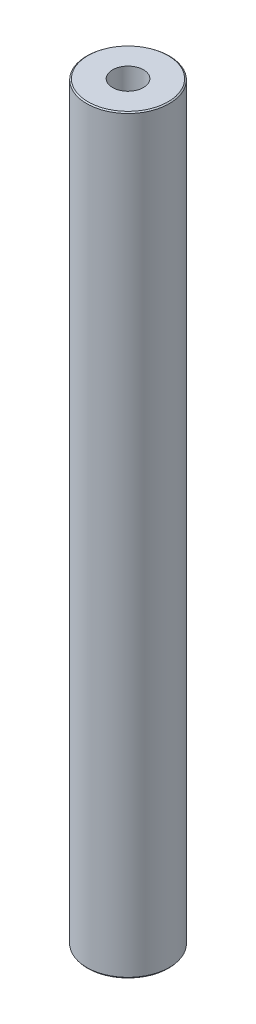
ISO-10303-21;
HEADER;
FILE_DESCRIPTION(('STEP AP214'),'2;1');
FILE_NAME('part.step','',(''),(''),'','','');
FILE_SCHEMA(('AUTOMOTIVE_DESIGN { 1 0 10303 214 1 1 1 1 }'));
ENDSEC;
DATA;
#1=APPLICATION_CONTEXT('core data for automotive mechanical design processes');
#2=APPLICATION_PROTOCOL_DEFINITION('international standard','automotive_design',2000,#1);
#3=PRODUCT_CONTEXT('',#1,'mechanical');
#4=PRODUCT('Part','Part','',(#3));
#5=PRODUCT_RELATED_PRODUCT_CATEGORY('part','',(#4));
#6=PRODUCT_DEFINITION_FORMATION('','',#4);
#7=PRODUCT_DEFINITION_CONTEXT('part definition',#1,'design');
#8=PRODUCT_DEFINITION('design','',#6,#7);
#9=PRODUCT_DEFINITION_SHAPE('','',#8);
#10=(LENGTH_UNIT() NAMED_UNIT(*) SI_UNIT(.MILLI.,.METRE.));
#11=(NAMED_UNIT(*) PLANE_ANGLE_UNIT() SI_UNIT($,.RADIAN.));
#12=(NAMED_UNIT(*) SI_UNIT($,.STERADIAN.) SOLID_ANGLE_UNIT());
#13=UNCERTAINTY_MEASURE_WITH_UNIT(LENGTH_MEASURE(1.E-05),#10,'distance_accuracy_value','');
#14=(GEOMETRIC_REPRESENTATION_CONTEXT(3) GLOBAL_UNCERTAINTY_ASSIGNED_CONTEXT((#13)) GLOBAL_UNIT_ASSIGNED_CONTEXT((#10,
#11,#12)) REPRESENTATION_CONTEXT('',''));
#15=CARTESIAN_POINT('',(0.,0.,0.));
#16=DIRECTION('',(0.,0.,1.));
#17=DIRECTION('',(1.,0.,0.));
#18=AXIS2_PLACEMENT_3D('',#15,#16,#17);
#19=CARTESIAN_POINT('',(0.,544.953721629666,0.));
#20=DIRECTION('',(0.,-1.,0.));
#21=DIRECTION('',(0.,0.,-1.));
#22=AXIS2_PLACEMENT_3D('',#19,#20,#21);
#23=CYLINDRICAL_SURFACE('',#22,30.);
#24=CARTESIAN_POINT('',(0.,544.239110756759,0.));
#25=DIRECTION('',(0.,1.,0.));
#26=DIRECTION('',(0.,0.,1.));
#27=AXIS2_PLACEMENT_3D('',#24,#25,#26);
#28=CIRCLE('',#27,30.);
#29=CARTESIAN_POINT('',(0.,544.239110756759,-30.));
#30=VERTEX_POINT('',#29);
#31=EDGE_CURVE('E50',#30,#30,#28,.F.);
#32=CARTESIAN_POINT('',(0.,0.913185378331627,0.));
#33=DIRECTION('',(0.,1.,0.));
#34=DIRECTION('',(0.,0.,1.));
#35=AXIS2_PLACEMENT_3D('',#32,#33,#34);
#36=CIRCLE('',#35,30.);
#37=CARTESIAN_POINT('',(0.,0.913185378331627,-30.));
#38=VERTEX_POINT('',#37);
#39=EDGE_CURVE('E51',#38,#38,#36,.T.);
#40=CARTESIAN_POINT('',(0.,544.239110756759,-30.));
#41=CARTESIAN_POINT('',(0.,538.579465700734,-30.));
#42=CARTESIAN_POINT('',(0.,532.919820644708,-30.));
#43=CARTESIAN_POINT('',(0.,521.600530532658,-30.));
#44=CARTESIAN_POINT('',(0.,515.940885476633,-30.));
#45=CARTESIAN_POINT('',(0.,504.621595364582,-30.));
#46=CARTESIAN_POINT('',(0.,498.961950308557,-30.));
#47=CARTESIAN_POINT('',(0.,487.642660196506,-30.));
#48=CARTESIAN_POINT('',(0.,481.983015140481,-30.));
#49=CARTESIAN_POINT('',(0.,470.66372502843,-30.));
#50=CARTESIAN_POINT('',(0.,465.004079972405,-30.));
#51=CARTESIAN_POINT('',(0.,453.684789860354,-30.));
#52=CARTESIAN_POINT('',(0.,448.025144804329,-30.));
#53=CARTESIAN_POINT('',(0.,436.705854692279,-30.));
#54=CARTESIAN_POINT('',(0.,431.046209636253,-30.));
#55=CARTESIAN_POINT('',(0.,419.726919524203,-30.));
#56=CARTESIAN_POINT('',(0.,414.067274468177,-30.));
#57=CARTESIAN_POINT('',(0.,402.747984356127,-30.));
#58=CARTESIAN_POINT('',(0.,397.088339300102,-30.));
#59=CARTESIAN_POINT('',(0.,385.769049188051,-30.));
#60=CARTESIAN_POINT('',(0.,380.109404132026,-30.));
#61=CARTESIAN_POINT('',(0.,368.790114019975,-30.));
#62=CARTESIAN_POINT('',(0.,363.13046896395,-30.));
#63=CARTESIAN_POINT('',(0.,351.811178851899,-30.));
#64=CARTESIAN_POINT('',(0.,346.151533795874,-30.));
#65=CARTESIAN_POINT('',(0.,334.832243683823,-30.));
#66=CARTESIAN_POINT('',(0.,329.172598627798,-30.));
#67=CARTESIAN_POINT('',(0.,317.853308515748,-30.));
#68=CARTESIAN_POINT('',(0.,312.193663459722,-30.));
#69=CARTESIAN_POINT('',(0.,300.874373347672,-30.));
#70=CARTESIAN_POINT('',(0.,295.214728291646,-30.));
#71=CARTESIAN_POINT('',(0.,283.895438179596,-30.));
#72=CARTESIAN_POINT('',(0.,278.235793123571,-30.));
#73=CARTESIAN_POINT('',(0.,266.91650301152,-30.));
#74=CARTESIAN_POINT('',(0.,261.256857955495,-30.));
#75=CARTESIAN_POINT('',(0.,249.937567843444,-30.));
#76=CARTESIAN_POINT('',(0.,244.277922787419,-30.));
#77=CARTESIAN_POINT('',(0.,232.958632675368,-30.));
#78=CARTESIAN_POINT('',(0.,227.298987619343,-30.));
#79=CARTESIAN_POINT('',(0.,215.979697507292,-30.));
#80=CARTESIAN_POINT('',(0.,210.320052451267,-30.));
#81=CARTESIAN_POINT('',(0.,199.000762339217,-30.));
#82=CARTESIAN_POINT('',(0.,193.341117283191,-30.));
#83=CARTESIAN_POINT('',(0.,182.021827171141,-30.));
#84=CARTESIAN_POINT('',(0.,176.362182115115,-30.));
#85=CARTESIAN_POINT('',(0.,165.042892003065,-30.));
#86=CARTESIAN_POINT('',(0.,159.38324694704,-30.));
#87=CARTESIAN_POINT('',(0.,148.063956834989,-30.));
#88=CARTESIAN_POINT('',(0.,142.404311778964,-30.));
#89=CARTESIAN_POINT('',(0.,131.085021666913,-30.));
#90=CARTESIAN_POINT('',(0.,125.425376610888,-30.));
#91=CARTESIAN_POINT('',(0.,114.106086498837,-30.));
#92=CARTESIAN_POINT('',(0.,108.446441442812,-30.));
#93=CARTESIAN_POINT('',(0.,97.1271513307614,-30.));
#94=CARTESIAN_POINT('',(0.,91.4675062747362,-30.));
#95=CARTESIAN_POINT('',(0.,80.1482161626856,-30.));
#96=CARTESIAN_POINT('',(0.,74.4885711066603,-30.));
#97=CARTESIAN_POINT('',(0.,63.1692809946097,-30.));
#98=CARTESIAN_POINT('',(0.,57.5096359385844,-30.));
#99=CARTESIAN_POINT('',(0.,46.1903458265339,-30.));
#100=CARTESIAN_POINT('',(0.,40.5307007705085,-30.));
#101=CARTESIAN_POINT('',(0.,29.211410658458,-30.));
#102=CARTESIAN_POINT('',(0.,23.5517656024327,-30.));
#103=CARTESIAN_POINT('',(0.,12.2324754903822,-30.));
#104=CARTESIAN_POINT('',(0.,6.57283043435689,-30.));
#105=CARTESIAN_POINT('',(0.,0.913185378331627,-30.));
#106=B_SPLINE_CURVE_WITH_KNOTS('',3,(#40,#41,#42,#43,#44,#45,#46,#47,#48,#49,#50,#51,#52,#53,
#54,#55,#56,#57,#58,#59,#60,#61,#62,#63,#64,#65,#66,#67,#68,#69,#70,#71,#72,#73,#74,#75,#76,#77,
#78,#79,#80,#81,#82,#83,#84,#85,#86,#87,#88,#89,#90,#91,#92,#93,#94,#95,#96,#97,#98,#99,#100,
#101,#102,#103,#104,#105),.UNSPECIFIED.,.F.,.F.,(4,2,2,2,2,2,2,2,2,2,2,2,2,2,2,2,2,2,2,2,2,2,2,
2,2,2,2,2,2,2,2,2,4),(0.,16.9789351680758,33.9578703361516,50.9368055042275,67.9157406723034,
84.8946758403792,101.873611008455,118.852546176531,135.831481344607,152.810416512683,
169.789351680759,186.768286848834,203.74722201691,220.726157184986,237.705092353062,
254.684027521138,271.662962689214,288.64189785729,305.620833025365,322.599768193441,
339.578703361517,356.557638529593,373.536573697669,390.515508865745,407.494444033821,
424.473379201896,441.452314369972,458.431249538048,475.410184706124,492.3891198742,
509.368055042276,526.346990210352,543.325925378427),.UNSPECIFIED.);
#107=EDGE_CURVE('BSEAM39',#30,#38,#106,.T.);
#108=ORIENTED_EDGE('',*,*,#31,.T.);
#109=ORIENTED_EDGE('',*,*,#39,.T.);
#110=ORIENTED_EDGE('',*,*,#107,.T.);
#111=ORIENTED_EDGE('',*,*,#107,.F.);
#112=EDGE_LOOP('',(#108,#110,#109,#111));
#113=FACE_BOUND('',#112,.T.);
#114=ADVANCED_FACE('F39',(#113),#23,.T.);
#115=CARTESIAN_POINT('',(0.,544.953721629666,0.));
#116=DIRECTION('',(0.,1.,0.));
#117=DIRECTION('',(0.,0.,1.));
#118=AXIS2_PLACEMENT_3D('',#115,#116,#117);
#119=PLANE('',#118);
#120=CARTESIAN_POINT('',(0.,544.953721629666,0.));
#121=DIRECTION('',(0.,1.,0.));
#122=DIRECTION('',(0.,0.,1.));
#123=AXIS2_PLACEMENT_3D('',#120,#121,#122);
#124=CIRCLE('',#123,29.0868146216682);
#125=CARTESIAN_POINT('',(0.,544.953721629666,-29.0868146216682));
#126=VERTEX_POINT('',#125);
#127=EDGE_CURVE('E54',#126,#126,#124,.T.);
#128=ORIENTED_EDGE('',*,*,#127,.T.);
#129=EDGE_LOOP('',(#128));
#130=FACE_BOUND('',#129,.T.);
#131=CARTESIAN_POINT('',(0.,544.953721629666,0.));
#132=DIRECTION('',(0.,1.,0.));
#133=DIRECTION('',(0.,0.,1.));
#134=AXIS2_PLACEMENT_3D('',#131,#132,#133);
#135=CIRCLE('',#134,11.2205086014266);
#136=CARTESIAN_POINT('',(0.,544.953721629666,11.2205086014266));
#137=VERTEX_POINT('',#136);
#138=EDGE_CURVE('E58',#137,#137,#135,.T.);
#139=ORIENTED_EDGE('',*,*,#138,.F.);
#140=EDGE_LOOP('',(#139));
#141=FACE_BOUND('',#140,.T.);
#142=ADVANCED_FACE('F69',(#130,#141),#119,.T.);
#143=CARTESIAN_POINT('',(0.,0.,0.));
#144=DIRECTION('',(0.,1.,0.));
#145=DIRECTION('',(0.,0.,1.));
#146=AXIS2_PLACEMENT_3D('',#143,#144,#145);
#147=PLANE('',#146);
#148=CARTESIAN_POINT('',(0.,0.,0.));
#149=DIRECTION('',(0.,1.,0.));
#150=DIRECTION('',(0.,0.,1.));
#151=AXIS2_PLACEMENT_3D('',#148,#149,#150);
#152=CIRCLE('',#151,29.2853891270933);
#153=CARTESIAN_POINT('',(0.,0.,29.2853891270933));
#154=VERTEX_POINT('',#153);
#155=EDGE_CURVE('E10',#154,#154,#152,.F.);
#156=ORIENTED_EDGE('',*,*,#155,.T.);
#157=EDGE_LOOP('',(#156));
#158=FACE_BOUND('',#157,.T.);
#159=CARTESIAN_POINT('',(0.,0.,0.));
#160=DIRECTION('',(0.,1.,0.));
#161=DIRECTION('',(0.,0.,1.));
#162=AXIS2_PLACEMENT_3D('',#159,#160,#161);
#163=CIRCLE('',#162,11.2205086014266);
#164=CARTESIAN_POINT('',(0.,0.,11.2205086014266));
#165=VERTEX_POINT('',#164);
#166=EDGE_CURVE('E63',#165,#165,#163,.T.);
#167=ORIENTED_EDGE('',*,*,#166,.T.);
#168=EDGE_LOOP('',(#167));
#169=FACE_BOUND('',#168,.T.);
#170=ADVANCED_FACE('F75',(#158,#169),#147,.F.);
#171=CARTESIAN_POINT('',(0.,544.953721629666,0.));
#172=DIRECTION('',(0.,-1.,0.));
#173=DIRECTION('',(0.,0.,-1.));
#174=AXIS2_PLACEMENT_3D('',#171,#172,#173);
#175=CYLINDRICAL_SURFACE('',#174,11.2205086014266);
#176=ORIENTED_EDGE('',*,*,#138,.T.);
#177=EDGE_LOOP('',(#176));
#178=FACE_BOUND('',#177,.T.);
#179=ORIENTED_EDGE('',*,*,#166,.F.);
#180=EDGE_LOOP('',(#179));
#181=FACE_BOUND('',#180,.T.);
#182=ADVANCED_FACE('F70',(#178,#181),#175,.F.);
#183=CARTESIAN_POINT('',(0.,544.953721629666,0.));
#184=DIRECTION('',(0.,-1.,0.));
#185=DIRECTION('',(0.,0.,-1.));
#186=AXIS2_PLACEMENT_3D('',#183,#184,#185);
#187=CONICAL_SURFACE('',#186,29.0868146216682,0.906788158513162);
#188=CARTESIAN_POINT('',(0.,544.239110756759,-30.0000000000001));
#189=CARTESIAN_POINT('',(0.,544.246554620019,-29.9904876523091));
#190=CARTESIAN_POINT('',(0.,544.253998483278,-29.9809753046181));
#191=CARTESIAN_POINT('',(0.,544.268886209797,-29.9619506092362));
#192=CARTESIAN_POINT('',(0.,544.276330073056,-29.9524382615453));
#193=CARTESIAN_POINT('',(0.,544.291217799575,-29.9334135661634));
#194=CARTESIAN_POINT('',(0.,544.298661662835,-29.9239012184724));
#195=CARTESIAN_POINT('',(0.,544.313549389354,-29.9048765230905));
#196=CARTESIAN_POINT('',(0.,544.320993252613,-29.8953641753995));
#197=CARTESIAN_POINT('',(0.,544.335880979132,-29.8763394800176));
#198=CARTESIAN_POINT('',(0.,544.343324842391,-29.8668271323267));
#199=CARTESIAN_POINT('',(0.,544.35821256891,-29.8478024369448));
#200=CARTESIAN_POINT('',(0.,544.36565643217,-29.8382900892538));
#201=CARTESIAN_POINT('',(0.,544.380544158689,-29.8192653938719));
#202=CARTESIAN_POINT('',(0.,544.387988021948,-29.8097530461809));
#203=CARTESIAN_POINT('',(0.,544.402875748467,-29.790728350799));
#204=CARTESIAN_POINT('',(0.,544.410319611726,-29.7812160031081));
#205=CARTESIAN_POINT('',(0.,544.425207338245,-29.7621913077262));
#206=CARTESIAN_POINT('',(0.,544.432651201505,-29.7526789600352));
#207=CARTESIAN_POINT('',(0.,544.447538928024,-29.7336542646533));
#208=CARTESIAN_POINT('',(0.,544.454982791283,-29.7241419169623));
#209=CARTESIAN_POINT('',(0.,544.469870517802,-29.7051172215804));
#210=CARTESIAN_POINT('',(0.,544.477314381061,-29.6956048738895));
#211=CARTESIAN_POINT('',(0.,544.49220210758,-29.6765801785075));
#212=CARTESIAN_POINT('',(0.,544.49964597084,-29.6670678308166));
#213=CARTESIAN_POINT('',(0.,544.514533697359,-29.6480431354347));
#214=CARTESIAN_POINT('',(0.,544.521977560618,-29.6385307877437));
#215=CARTESIAN_POINT('',(0.,544.536865287137,-29.6195060923618));
#216=CARTESIAN_POINT('',(0.,544.544309150396,-29.6099937446708));
#217=CARTESIAN_POINT('',(0.,544.559196876915,-29.5909690492889));
#218=CARTESIAN_POINT('',(0.,544.566640740175,-29.581456701598));
#219=CARTESIAN_POINT('',(0.,544.581528466694,-29.5624320062161));
#220=CARTESIAN_POINT('',(0.,544.588972329953,-29.5529196585251));
#221=CARTESIAN_POINT('',(0.,544.603860056472,-29.5338949631432));
#222=CARTESIAN_POINT('',(0.,544.611303919731,-29.5243826154522));
#223=CARTESIAN_POINT('',(0.,544.62619164625,-29.5053579200703));
#224=CARTESIAN_POINT('',(0.,544.63363550951,-29.4958455723794));
#225=CARTESIAN_POINT('',(0.,544.648523236029,-29.4768208769975));
#226=CARTESIAN_POINT('',(0.,544.655967099288,-29.4673085293065));
#227=CARTESIAN_POINT('',(0.,544.670854825807,-29.4482838339246));
#228=CARTESIAN_POINT('',(0.,544.678298689066,-29.4387714862336));
#229=CARTESIAN_POINT('',(0.,544.693186415585,-29.4197467908517));
#230=CARTESIAN_POINT('',(0.,544.700630278845,-29.4102344431608));
#231=CARTESIAN_POINT('',(0.,544.715518005364,-29.3912097477789));
#232=CARTESIAN_POINT('',(0.,544.722961868623,-29.3816974000879));
#233=CARTESIAN_POINT('',(0.,544.737849595142,-29.362672704706));
#234=CARTESIAN_POINT('',(0.,544.745293458401,-29.353160357015));
#235=CARTESIAN_POINT('',(0.,544.76018118492,-29.3341356616331));
#236=CARTESIAN_POINT('',(0.,544.76762504818,-29.3246233139422));
#237=CARTESIAN_POINT('',(0.,544.782512774699,-29.3055986185602));
#238=CARTESIAN_POINT('',(0.,544.789956637958,-29.2960862708693));
#239=CARTESIAN_POINT('',(0.,544.804844364477,-29.2770615754874));
#240=CARTESIAN_POINT('',(0.,544.812288227736,-29.2675492277964));
#241=CARTESIAN_POINT('',(0.,544.827175954255,-29.2485245324145));
#242=CARTESIAN_POINT('',(0.,544.834619817515,-29.2390121847235));
#243=CARTESIAN_POINT('',(0.,544.849507544034,-29.2199874893416));
#244=CARTESIAN_POINT('',(0.,544.856951407293,-29.2104751416507));
#245=CARTESIAN_POINT('',(0.,544.871839133812,-29.1914504462688));
#246=CARTESIAN_POINT('',(0.,544.879282997071,-29.1819380985778));
#247=CARTESIAN_POINT('',(0.,544.89417072359,-29.1629134031959));
#248=CARTESIAN_POINT('',(0.,544.90161458685,-29.1534010555049));
#249=CARTESIAN_POINT('',(0.,544.916502313369,-29.134376360123));
#250=CARTESIAN_POINT('',(0.,544.923946176628,-29.1248640124321));
#251=CARTESIAN_POINT('',(0.,544.938833903147,-29.1058393170502));
#252=CARTESIAN_POINT('',(0.,544.946277766407,-29.0963269693592));
#253=CARTESIAN_POINT('',(0.,544.953721629666,-29.0868146216682));
#254=B_SPLINE_CURVE_WITH_KNOTS('',3,(#188,#189,#190,#191,#192,#193,#194,#195,#196,#197,#198,
#199,#200,#201,#202,#203,#204,#205,#206,#207,#208,#209,#210,#211,#212,#213,#214,#215,#216,#217,
#218,#219,#220,#221,#222,#223,#224,#225,#226,#227,#228,#229,#230,#231,#232,#233,#234,#235,#236,
#237,#238,#239,#240,#241,#242,#243,#244,#245,#246,#247,#248,#249,#250,#251,#252,#253),
.UNSPECIFIED.,.F.,.F.,(4,2,2,2,2,2,2,2,2,2,2,2,2,2,2,2,2,2,2,2,2,2,2,2,2,2,2,2,2,2,2,2,4),(0.,
0.0362362074363131,0.0724724148726974,0.108708622309013,0.144944829745397,0.181181037181779,
0.217417244618095,0.253653452054479,0.289889659490863,0.326125866927176,0.362362074363561,
0.398598281799876,0.434834489236261,0.471070696672642,0.507306904108958,0.543543111545343,
0.579779318981727,0.61601552641804,0.652251733854424,0.68848794129074,0.724724148727124,
0.760960356163506,0.797196563599822,0.833432771036206,0.86966897847259,0.905905185908903,
0.942141393345288,0.978377600781603,1.01461380821799,1.05085001565437,1.08708622309069,
1.12332243052707,1.15955863796345),.UNSPECIFIED.);
#255=EDGE_CURVE('BSEAM81',#30,#126,#254,.T.);
#256=ORIENTED_EDGE('',*,*,#31,.F.);
#257=ORIENTED_EDGE('',*,*,#127,.F.);
#258=ORIENTED_EDGE('',*,*,#255,.T.);
#259=ORIENTED_EDGE('',*,*,#255,.F.);
#260=EDGE_LOOP('',(#256,#258,#257,#259));
#261=FACE_BOUND('',#260,.T.);
#262=ADVANCED_FACE('F81',(#261),#187,.T.);
#263=CARTESIAN_POINT('',(0.,0.913185378331627,0.));
#264=DIRECTION('',(0.,1.,0.));
#265=DIRECTION('',(0.,0.,1.));
#266=AXIS2_PLACEMENT_3D('',#263,#264,#265);
#267=CONICAL_SURFACE('',#266,30.,0.664008168281781);
#268=ORIENTED_EDGE('',*,*,#155,.F.);
#269=EDGE_LOOP('',(#268));
#270=FACE_BOUND('',#269,.T.);
#271=ORIENTED_EDGE('',*,*,#39,.F.);
#272=EDGE_LOOP('',(#271));
#273=FACE_BOUND('',#272,.T.);
#274=ADVANCED_FACE('F45',(#270,#273),#267,.T.);
#275=CLOSED_SHELL('',(#114,#142,#170,#182,#262,#274));
#276=MANIFOLD_SOLID_BREP('B2',#275);
#277=ADVANCED_BREP_SHAPE_REPRESENTATION('',(#18,#276),#14);
#278=SHAPE_DEFINITION_REPRESENTATION(#9,#277);
ENDSEC;
END-ISO-10303-21;
